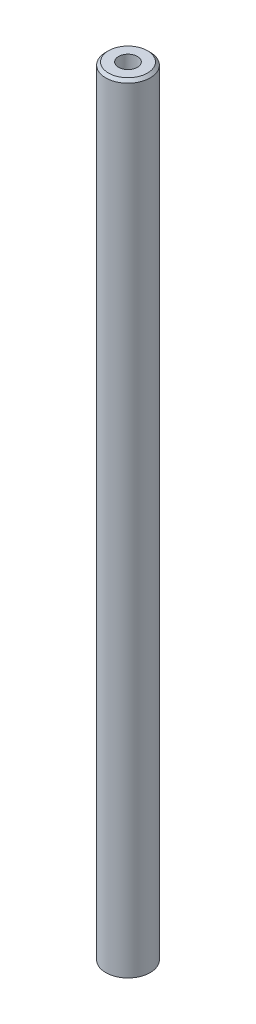
ISO-10303-21;
HEADER;
FILE_DESCRIPTION(('STEP AP214'),'2;1');
FILE_NAME('part.step','',(''),(''),'','','');
FILE_SCHEMA(('AUTOMOTIVE_DESIGN { 1 0 10303 214 1 1 1 1 }'));
ENDSEC;
DATA;
#1=APPLICATION_CONTEXT('core data for automotive mechanical design processes');
#2=APPLICATION_PROTOCOL_DEFINITION('international standard','automotive_design',2000,#1);
#3=PRODUCT_CONTEXT('',#1,'mechanical');
#4=PRODUCT('Part','Part','',(#3));
#5=PRODUCT_RELATED_PRODUCT_CATEGORY('part','',(#4));
#6=PRODUCT_DEFINITION_FORMATION('','',#4);
#7=PRODUCT_DEFINITION_CONTEXT('part definition',#1,'design');
#8=PRODUCT_DEFINITION('design','',#6,#7);
#9=PRODUCT_DEFINITION_SHAPE('','',#8);
#10=(LENGTH_UNIT() NAMED_UNIT(*) SI_UNIT(.MILLI.,.METRE.));
#11=(NAMED_UNIT(*) PLANE_ANGLE_UNIT() SI_UNIT($,.RADIAN.));
#12=(NAMED_UNIT(*) SI_UNIT($,.STERADIAN.) SOLID_ANGLE_UNIT());
#13=UNCERTAINTY_MEASURE_WITH_UNIT(LENGTH_MEASURE(1.E-05),#10,'distance_accuracy_value','');
#14=(GEOMETRIC_REPRESENTATION_CONTEXT(3) GLOBAL_UNCERTAINTY_ASSIGNED_CONTEXT((#13)) GLOBAL_UNIT_ASSIGNED_CONTEXT((#10,
#11,#12)) REPRESENTATION_CONTEXT('',''));
#15=CARTESIAN_POINT('',(0.,0.,0.));
#16=DIRECTION('',(0.,0.,1.));
#17=DIRECTION('',(1.,0.,0.));
#18=AXIS2_PLACEMENT_3D('',#15,#16,#17);
#19=CARTESIAN_POINT('',(0.,140.,0.));
#20=DIRECTION('',(0.,-1.,0.));
#21=DIRECTION('',(0.,0.,-1.));
#22=AXIS2_PLACEMENT_3D('',#19,#20,#21);
#23=CYLINDRICAL_SURFACE('',#22,8.);
#24=CARTESIAN_POINT('',(0.,139.,0.));
#25=DIRECTION('',(0.,1.,0.));
#26=DIRECTION('',(0.,0.,1.));
#27=AXIS2_PLACEMENT_3D('',#24,#25,#26);
#28=CIRCLE('',#27,8.);
#29=CARTESIAN_POINT('',(0.,139.,8.));
#30=VERTEX_POINT('',#29);
#31=EDGE_CURVE('E11',#30,#30,#28,.F.);
#32=ORIENTED_EDGE('',*,*,#31,.T.);
#33=EDGE_LOOP('',(#32));
#34=FACE_BOUND('',#33,.T.);
#35=CARTESIAN_POINT('',(0.,-140.,0.));
#36=DIRECTION('',(0.,1.,0.));
#37=DIRECTION('',(0.,0.,1.));
#38=AXIS2_PLACEMENT_3D('',#35,#36,#37);
#39=CIRCLE('',#38,8.);
#40=CARTESIAN_POINT('',(0.,-140.,8.));
#41=VERTEX_POINT('',#40);
#42=EDGE_CURVE('E66',#41,#41,#39,.T.);
#43=ORIENTED_EDGE('',*,*,#42,.T.);
#44=EDGE_LOOP('',(#43));
#45=FACE_BOUND('',#44,.T.);
#46=ADVANCED_FACE('F45',(#34,#45),#23,.T.);
#47=CARTESIAN_POINT('',(0.,140.,0.));
#48=DIRECTION('',(0.,1.,0.));
#49=DIRECTION('',(0.,0.,1.));
#50=AXIS2_PLACEMENT_3D('',#47,#48,#49);
#51=PLANE('',#50);
#52=CARTESIAN_POINT('',(0.,140.,0.));
#53=DIRECTION('',(0.,1.,0.));
#54=DIRECTION('',(0.,0.,1.));
#55=AXIS2_PLACEMENT_3D('',#52,#53,#54);
#56=CIRCLE('',#55,7.00000000000009);
#57=CARTESIAN_POINT('',(0.,140.,7.00000000000009));
#58=VERTEX_POINT('',#57);
#59=EDGE_CURVE('E53',#58,#58,#56,.T.);
#60=ORIENTED_EDGE('',*,*,#59,.T.);
#61=EDGE_LOOP('',(#60));
#62=FACE_BOUND('',#61,.T.);
#63=CARTESIAN_POINT('',(0.,140.,0.));
#64=DIRECTION('',(0.,1.,0.));
#65=DIRECTION('',(0.,0.,1.));
#66=AXIS2_PLACEMENT_3D('',#63,#64,#65);
#67=CIRCLE('',#66,3.4);
#68=CARTESIAN_POINT('',(0.,140.,3.4));
#69=VERTEX_POINT('',#68);
#70=EDGE_CURVE('E67',#69,#69,#67,.T.);
#71=ORIENTED_EDGE('',*,*,#70,.F.);
#72=EDGE_LOOP('',(#71));
#73=FACE_BOUND('',#72,.T.);
#74=ADVANCED_FACE('F76',(#62,#73),#51,.T.);
#75=CARTESIAN_POINT('',(0.,-140.,0.));
#76=DIRECTION('',(0.,1.,0.));
#77=DIRECTION('',(0.,0.,1.));
#78=AXIS2_PLACEMENT_3D('',#75,#76,#77);
#79=PLANE('',#78);
#80=ORIENTED_EDGE('',*,*,#42,.F.);
#81=EDGE_LOOP('',(#80));
#82=FACE_BOUND('',#81,.T.);
#83=ADVANCED_FACE('F60',(#82),#79,.F.);
#84=CARTESIAN_POINT('',(0.,120.25,0.));
#85=DIRECTION('',(0.,1.,0.));
#86=DIRECTION('',(0.,0.,1.));
#87=AXIS2_PLACEMENT_3D('',#84,#85,#86);
#88=CONICAL_SURFACE('',#87,3.4,1.02974425867665);
#89=CARTESIAN_POINT('',(0.,118.207073895306,0.));
#90=VERTEX_POINT('',#89);
#91=VERTEX_LOOP('',#90);
#92=FACE_BOUND('',#91,.T.);
#93=CARTESIAN_POINT('',(0.,120.25,0.));
#94=DIRECTION('',(0.,1.,0.));
#95=DIRECTION('',(0.,0.,1.));
#96=AXIS2_PLACEMENT_3D('',#93,#94,#95);
#97=CIRCLE('',#96,3.4);
#98=CARTESIAN_POINT('',(0.,120.25,3.4));
#99=VERTEX_POINT('',#98);
#100=EDGE_CURVE('E64',#99,#99,#97,.T.);
#101=ORIENTED_EDGE('',*,*,#100,.T.);
#102=EDGE_LOOP('',(#101));
#103=FACE_BOUND('',#102,.T.);
#104=ADVANCED_FACE('F56',(#92,#103),#88,.F.);
#105=CARTESIAN_POINT('',(0.,140.,0.));
#106=DIRECTION('',(0.,1.,0.));
#107=DIRECTION('',(0.,0.,1.));
#108=AXIS2_PLACEMENT_3D('',#105,#106,#107);
#109=CYLINDRICAL_SURFACE('',#108,3.4);
#110=ORIENTED_EDGE('',*,*,#100,.F.);
#111=EDGE_LOOP('',(#110));
#112=FACE_BOUND('',#111,.T.);
#113=ORIENTED_EDGE('',*,*,#70,.T.);
#114=EDGE_LOOP('',(#113));
#115=FACE_BOUND('',#114,.T.);
#116=ADVANCED_FACE('F59',(#112,#115),#109,.F.);
#117=CARTESIAN_POINT('',(0.,140.,0.));
#118=DIRECTION('',(0.,-1.,0.));
#119=DIRECTION('',(0.,0.,-1.));
#120=AXIS2_PLACEMENT_3D('',#117,#118,#119);
#121=CONICAL_SURFACE('',#120,7.00000000000009,0.785398163397431);
#122=ORIENTED_EDGE('',*,*,#31,.F.);
#123=EDGE_LOOP('',(#122));
#124=FACE_BOUND('',#123,.T.);
#125=ORIENTED_EDGE('',*,*,#59,.F.);
#126=EDGE_LOOP('',(#125));
#127=FACE_BOUND('',#126,.T.);
#128=ADVANCED_FACE('F48',(#124,#127),#121,.T.);
#129=CLOSED_SHELL('',(#46,#74,#83,#104,#116,#128));
#130=MANIFOLD_SOLID_BREP('B2',#129);
#131=ADVANCED_BREP_SHAPE_REPRESENTATION('',(#18,#130),#14);
#132=SHAPE_DEFINITION_REPRESENTATION(#9,#131);
ENDSEC;
END-ISO-10303-21;
